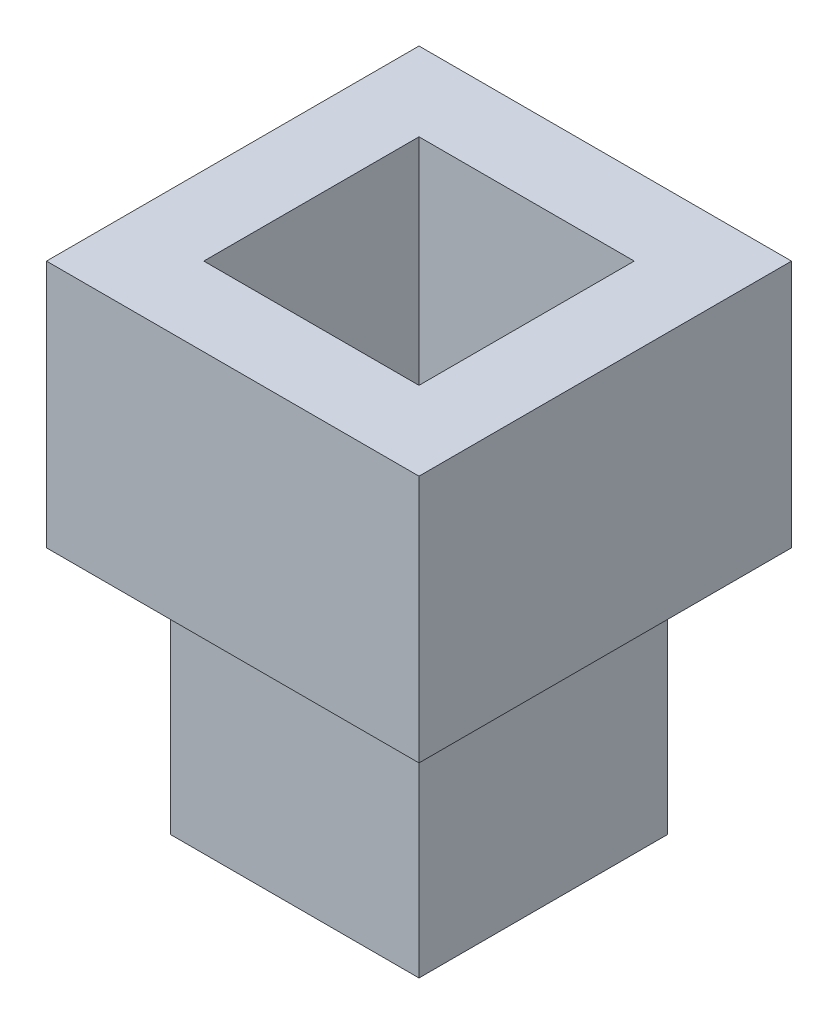
ISO-10303-21;
HEADER;
FILE_DESCRIPTION(('STEP AP214'),'2;1');
FILE_NAME('part.step','',(''),(''),'','','');
FILE_SCHEMA(('AUTOMOTIVE_DESIGN { 1 0 10303 214 1 1 1 1 }'));
ENDSEC;
DATA;
#1=APPLICATION_CONTEXT('core data for automotive mechanical design processes');
#2=APPLICATION_PROTOCOL_DEFINITION('international standard','automotive_design',2000,#1);
#3=PRODUCT_CONTEXT('',#1,'mechanical');
#4=PRODUCT('Part','Part','',(#3));
#5=PRODUCT_RELATED_PRODUCT_CATEGORY('part','',(#4));
#6=PRODUCT_DEFINITION_FORMATION('','',#4);
#7=PRODUCT_DEFINITION_CONTEXT('part definition',#1,'design');
#8=PRODUCT_DEFINITION('design','',#6,#7);
#9=PRODUCT_DEFINITION_SHAPE('','',#8);
#10=(LENGTH_UNIT() NAMED_UNIT(*) SI_UNIT(.MILLI.,.METRE.));
#11=(NAMED_UNIT(*) PLANE_ANGLE_UNIT() SI_UNIT($,.RADIAN.));
#12=(NAMED_UNIT(*) SI_UNIT($,.STERADIAN.) SOLID_ANGLE_UNIT());
#13=UNCERTAINTY_MEASURE_WITH_UNIT(LENGTH_MEASURE(1.E-05),#10,'distance_accuracy_value','');
#14=(GEOMETRIC_REPRESENTATION_CONTEXT(3) GLOBAL_UNCERTAINTY_ASSIGNED_CONTEXT((#13)) GLOBAL_UNIT_ASSIGNED_CONTEXT((#10,
#11,#12)) REPRESENTATION_CONTEXT('',''));
#15=CARTESIAN_POINT('',(0.,0.,0.));
#16=DIRECTION('',(0.,0.,1.));
#17=DIRECTION('',(1.,0.,0.));
#18=AXIS2_PLACEMENT_3D('',#15,#16,#17);
#19=CARTESIAN_POINT('',(0.,30.,0.));
#20=DIRECTION('',(1.,0.,0.));
#21=DIRECTION('',(0.,0.,-1.));
#22=AXIS2_PLACEMENT_3D('',#19,#20,#21);
#23=PLANE('',#22);
#24=DIRECTION('',(0.,0.,1.));
#25=VECTOR('',#24,1.);
#26=CARTESIAN_POINT('',(0.,0.,0.));
#27=LINE('',#26,#25);
#28=CARTESIAN_POINT('',(0.,0.,-30.));
#29=VERTEX_POINT('',#28);
#30=CARTESIAN_POINT('',(0.,0.,0.));
#31=VERTEX_POINT('',#30);
#32=EDGE_CURVE('E243',#29,#31,#27,.T.);
#33=ORIENTED_EDGE('',*,*,#32,.T.);
#34=DIRECTION('',(0.,-1.,0.));
#35=VECTOR('',#34,1.);
#36=CARTESIAN_POINT('',(0.,30.,0.));
#37=LINE('',#36,#35);
#38=CARTESIAN_POINT('',(0.,30.,0.));
#39=VERTEX_POINT('',#38);
#40=EDGE_CURVE('E11',#39,#31,#37,.T.);
#41=ORIENTED_EDGE('',*,*,#40,.F.);
#42=DIRECTION('',(0.,0.,1.));
#43=VECTOR('',#42,1.);
#44=CARTESIAN_POINT('',(0.,30.,0.));
#45=LINE('',#44,#43);
#46=CARTESIAN_POINT('',(0.,30.,-30.));
#47=VERTEX_POINT('',#46);
#48=EDGE_CURVE('E244',#47,#39,#45,.T.);
#49=ORIENTED_EDGE('',*,*,#48,.F.);
#50=DIRECTION('',(0.,-1.,0.));
#51=VECTOR('',#50,1.);
#52=CARTESIAN_POINT('',(0.,30.,-30.));
#53=LINE('',#52,#51);
#54=EDGE_CURVE('E258',#47,#29,#53,.T.);
#55=ORIENTED_EDGE('',*,*,#54,.T.);
#56=EDGE_LOOP('',(#33,#41,#49,#55));
#57=FACE_BOUND('',#56,.T.);
#58=ADVANCED_FACE('F39',(#57),#23,.F.);
#59=CARTESIAN_POINT('',(0.,30.,0.));
#60=DIRECTION('',(0.,0.,-1.));
#61=DIRECTION('',(-1.,0.,0.));
#62=AXIS2_PLACEMENT_3D('',#59,#60,#61);
#63=PLANE('',#62);
#64=DIRECTION('',(1.,0.,0.));
#65=VECTOR('',#64,1.);
#66=CARTESIAN_POINT('',(0.,0.,0.));
#67=LINE('',#66,#65);
#68=CARTESIAN_POINT('',(30.,0.,0.));
#69=VERTEX_POINT('',#68);
#70=EDGE_CURVE('E262',#31,#69,#67,.T.);
#71=ORIENTED_EDGE('',*,*,#70,.T.);
#72=DIRECTION('',(0.,-1.,0.));
#73=VECTOR('',#72,1.);
#74=CARTESIAN_POINT('',(30.,30.,0.));
#75=LINE('',#74,#73);
#76=CARTESIAN_POINT('',(30.,30.,0.));
#77=VERTEX_POINT('',#76);
#78=EDGE_CURVE('E48',#77,#69,#75,.T.);
#79=ORIENTED_EDGE('',*,*,#78,.F.);
#80=DIRECTION('',(1.,0.,0.));
#81=VECTOR('',#80,1.);
#82=CARTESIAN_POINT('',(0.,30.,0.));
#83=LINE('',#82,#81);
#84=EDGE_CURVE('E89',#39,#77,#83,.T.);
#85=ORIENTED_EDGE('',*,*,#84,.F.);
#86=ORIENTED_EDGE('',*,*,#40,.T.);
#87=EDGE_LOOP('',(#71,#79,#85,#86));
#88=FACE_BOUND('',#87,.T.);
#89=ADVANCED_FACE('F302',(#88),#63,.F.);
#90=CARTESIAN_POINT('',(30.,30.,0.));
#91=DIRECTION('',(-1.,0.,0.));
#92=DIRECTION('',(0.,0.,1.));
#93=AXIS2_PLACEMENT_3D('',#90,#91,#92);
#94=PLANE('',#93);
#95=DIRECTION('',(0.,0.,-1.));
#96=VECTOR('',#95,1.);
#97=CARTESIAN_POINT('',(30.,0.,0.));
#98=LINE('',#97,#96);
#99=CARTESIAN_POINT('',(30.,0.,-30.));
#100=VERTEX_POINT('',#99);
#101=EDGE_CURVE('E265',#69,#100,#98,.T.);
#102=ORIENTED_EDGE('',*,*,#101,.T.);
#103=DIRECTION('',(0.,-1.,0.));
#104=VECTOR('',#103,1.);
#105=CARTESIAN_POINT('',(30.,30.,-30.));
#106=LINE('',#105,#104);
#107=CARTESIAN_POINT('',(30.,30.,-30.));
#108=VERTEX_POINT('',#107);
#109=EDGE_CURVE('E64',#108,#100,#106,.T.);
#110=ORIENTED_EDGE('',*,*,#109,.F.);
#111=DIRECTION('',(0.,0.,-1.));
#112=VECTOR('',#111,1.);
#113=CARTESIAN_POINT('',(30.,30.,0.));
#114=LINE('',#113,#112);
#115=EDGE_CURVE('E250',#77,#108,#114,.T.);
#116=ORIENTED_EDGE('',*,*,#115,.F.);
#117=ORIENTED_EDGE('',*,*,#78,.T.);
#118=EDGE_LOOP('',(#102,#110,#116,#117));
#119=FACE_BOUND('',#118,.T.);
#120=ADVANCED_FACE('F277',(#119),#94,.F.);
#121=CARTESIAN_POINT('',(0.,30.,-30.));
#122=DIRECTION('',(0.,0.,1.));
#123=DIRECTION('',(1.,0.,0.));
#124=AXIS2_PLACEMENT_3D('',#121,#122,#123);
#125=PLANE('',#124);
#126=DIRECTION('',(-1.,0.,0.));
#127=VECTOR('',#126,1.);
#128=CARTESIAN_POINT('',(0.,0.,-30.));
#129=LINE('',#128,#127);
#130=EDGE_CURVE('E84',#100,#29,#129,.T.);
#131=ORIENTED_EDGE('',*,*,#130,.T.);
#132=ORIENTED_EDGE('',*,*,#54,.F.);
#133=DIRECTION('',(-1.,0.,0.));
#134=VECTOR('',#133,1.);
#135=CARTESIAN_POINT('',(0.,30.,-30.));
#136=LINE('',#135,#134);
#137=EDGE_CURVE('E254',#108,#47,#136,.T.);
#138=ORIENTED_EDGE('',*,*,#137,.F.);
#139=ORIENTED_EDGE('',*,*,#109,.T.);
#140=EDGE_LOOP('',(#131,#132,#138,#139));
#141=FACE_BOUND('',#140,.T.);
#142=ADVANCED_FACE('F282',(#141),#125,.F.);
#143=CARTESIAN_POINT('',(0.,0.,0.));
#144=DIRECTION('',(0.,-1.,0.));
#145=DIRECTION('',(0.,0.,-1.));
#146=AXIS2_PLACEMENT_3D('',#143,#144,#145);
#147=PLANE('',#146);
#148=CARTESIAN_POINT('',(25.,0.,-5.));
#149=DIRECTION('',(0.,-1.,0.));
#150=DIRECTION('',(0.,0.,-1.));
#151=AXIS2_PLACEMENT_3D('',#148,#149,#150);
#152=CIRCLE('',#151,2.5);
#153=CARTESIAN_POINT('',(25.,0.,-7.5));
#154=VERTEX_POINT('',#153);
#155=EDGE_CURVE('E416',#154,#154,#152,.T.);
#156=ORIENTED_EDGE('',*,*,#155,.F.);
#157=EDGE_LOOP('',(#156));
#158=FACE_BOUND('',#157,.T.);
#159=CARTESIAN_POINT('',(5.,0.,-5.));
#160=DIRECTION('',(0.,-1.,0.));
#161=DIRECTION('',(0.,0.,-1.));
#162=AXIS2_PLACEMENT_3D('',#159,#160,#161);
#163=CIRCLE('',#162,2.5);
#164=CARTESIAN_POINT('',(5.,0.,-7.5));
#165=VERTEX_POINT('',#164);
#166=EDGE_CURVE('E408',#165,#165,#163,.T.);
#167=ORIENTED_EDGE('',*,*,#166,.F.);
#168=EDGE_LOOP('',(#167));
#169=FACE_BOUND('',#168,.T.);
#170=CARTESIAN_POINT('',(5.,0.,-25.));
#171=DIRECTION('',(0.,-1.,0.));
#172=DIRECTION('',(0.,0.,-1.));
#173=AXIS2_PLACEMENT_3D('',#170,#171,#172);
#174=CIRCLE('',#173,2.5);
#175=CARTESIAN_POINT('',(5.,0.,-27.5));
#176=VERTEX_POINT('',#175);
#177=EDGE_CURVE('E396',#176,#176,#174,.T.);
#178=ORIENTED_EDGE('',*,*,#177,.F.);
#179=EDGE_LOOP('',(#178));
#180=FACE_BOUND('',#179,.T.);
#181=CARTESIAN_POINT('',(25.,0.,-25.));
#182=DIRECTION('',(0.,-1.,0.));
#183=DIRECTION('',(0.,0.,-1.));
#184=AXIS2_PLACEMENT_3D('',#181,#182,#183);
#185=CIRCLE('',#184,2.5);
#186=CARTESIAN_POINT('',(25.,0.,-27.5));
#187=VERTEX_POINT('',#186);
#188=EDGE_CURVE('E170',#187,#187,#185,.T.);
#189=ORIENTED_EDGE('',*,*,#188,.F.);
#190=EDGE_LOOP('',(#189));
#191=FACE_BOUND('',#190,.T.);
#192=ORIENTED_EDGE('',*,*,#32,.F.);
#193=ORIENTED_EDGE('',*,*,#130,.F.);
#194=ORIENTED_EDGE('',*,*,#101,.F.);
#195=ORIENTED_EDGE('',*,*,#70,.F.);
#196=EDGE_LOOP('',(#192,#193,#194,#195));
#197=FACE_BOUND('',#196,.T.);
#198=ADVANCED_FACE('F280',(#158,#169,#180,#191,#197),#147,.T.);
#199=CARTESIAN_POINT('',(0.,30.,0.));
#200=DIRECTION('',(0.,1.,0.));
#201=DIRECTION('',(0.,0.,1.));
#202=AXIS2_PLACEMENT_3D('',#199,#200,#201);
#203=PLANE('',#202);
#204=DIRECTION('',(0.,0.,1.));
#205=VECTOR('',#204,1.);
#206=CARTESIAN_POINT('',(-7.50000000000001,30.,-37.5));
#207=LINE('',#206,#205);
#208=CARTESIAN_POINT('',(-7.50000000000001,30.,-37.5));
#209=VERTEX_POINT('',#208);
#210=CARTESIAN_POINT('',(-7.5,30.,7.5));
#211=VERTEX_POINT('',#210);
#212=EDGE_CURVE('E214',#209,#211,#207,.T.);
#213=ORIENTED_EDGE('',*,*,#212,.F.);
#214=DIRECTION('',(-1.,0.,0.));
#215=VECTOR('',#214,1.);
#216=CARTESIAN_POINT('',(-7.50000000000001,30.,-37.5));
#217=LINE('',#216,#215);
#218=CARTESIAN_POINT('',(37.5,30.,-37.5));
#219=VERTEX_POINT('',#218);
#220=EDGE_CURVE('E224',#219,#209,#217,.T.);
#221=ORIENTED_EDGE('',*,*,#220,.F.);
#222=DIRECTION('',(0.,0.,-1.));
#223=VECTOR('',#222,1.);
#224=CARTESIAN_POINT('',(37.5,30.,-37.5));
#225=LINE('',#224,#223);
#226=CARTESIAN_POINT('',(37.5,30.,7.5));
#227=VERTEX_POINT('',#226);
#228=EDGE_CURVE('E221',#227,#219,#225,.T.);
#229=ORIENTED_EDGE('',*,*,#228,.F.);
#230=DIRECTION('',(1.,0.,0.));
#231=VECTOR('',#230,1.);
#232=CARTESIAN_POINT('',(-7.5,30.,7.5));
#233=LINE('',#232,#231);
#234=EDGE_CURVE('E218',#211,#227,#233,.T.);
#235=ORIENTED_EDGE('',*,*,#234,.F.);
#236=EDGE_LOOP('',(#213,#221,#229,#235));
#237=FACE_BOUND('',#236,.T.);
#238=ORIENTED_EDGE('',*,*,#137,.T.);
#239=ORIENTED_EDGE('',*,*,#48,.T.);
#240=ORIENTED_EDGE('',*,*,#84,.T.);
#241=ORIENTED_EDGE('',*,*,#115,.T.);
#242=EDGE_LOOP('',(#238,#239,#240,#241));
#243=FACE_BOUND('',#242,.T.);
#244=ADVANCED_FACE('F284',(#237,#243),#203,.F.);
#245=CARTESIAN_POINT('',(-7.50000000000001,40.,-37.5));
#246=DIRECTION('',(1.,0.,0.));
#247=DIRECTION('',(0.,0.,-1.));
#248=AXIS2_PLACEMENT_3D('',#245,#246,#247);
#249=PLANE('',#248);
#250=ORIENTED_EDGE('',*,*,#212,.T.);
#251=DIRECTION('',(0.,-1.,0.));
#252=VECTOR('',#251,1.);
#253=CARTESIAN_POINT('',(-7.5,40.,7.5));
#254=LINE('',#253,#252);
#255=CARTESIAN_POINT('',(-7.50000000000001,60.,7.5));
#256=VERTEX_POINT('',#255);
#257=EDGE_CURVE('E239',#256,#211,#254,.T.);
#258=ORIENTED_EDGE('',*,*,#257,.F.);
#259=DIRECTION('',(0.,0.,1.));
#260=VECTOR('',#259,1.);
#261=CARTESIAN_POINT('',(-7.50000000000001,60.,-37.5));
#262=LINE('',#261,#260);
#263=CARTESIAN_POINT('',(-7.50000000000001,60.,-37.5));
#264=VERTEX_POINT('',#263);
#265=EDGE_CURVE('E198',#264,#256,#262,.T.);
#266=ORIENTED_EDGE('',*,*,#265,.F.);
#267=DIRECTION('',(0.,-1.,0.));
#268=VECTOR('',#267,1.);
#269=CARTESIAN_POINT('',(-7.50000000000001,40.,-37.5));
#270=LINE('',#269,#268);
#271=EDGE_CURVE('E227',#264,#209,#270,.T.);
#272=ORIENTED_EDGE('',*,*,#271,.T.);
#273=EDGE_LOOP('',(#250,#258,#266,#272));
#274=FACE_BOUND('',#273,.T.);
#275=ADVANCED_FACE('F286',(#274),#249,.F.);
#276=CARTESIAN_POINT('',(-7.5,40.,7.5));
#277=DIRECTION('',(0.,0.,-1.));
#278=DIRECTION('',(-1.,0.,0.));
#279=AXIS2_PLACEMENT_3D('',#276,#277,#278);
#280=PLANE('',#279);
#281=ORIENTED_EDGE('',*,*,#234,.T.);
#282=DIRECTION('',(0.,-1.,0.));
#283=VECTOR('',#282,1.);
#284=CARTESIAN_POINT('',(37.5,40.,7.5));
#285=LINE('',#284,#283);
#286=CARTESIAN_POINT('',(37.5,60.,7.5));
#287=VERTEX_POINT('',#286);
#288=EDGE_CURVE('E235',#287,#227,#285,.T.);
#289=ORIENTED_EDGE('',*,*,#288,.F.);
#290=DIRECTION('',(1.,0.,0.));
#291=VECTOR('',#290,1.);
#292=CARTESIAN_POINT('',(-7.50000000000001,60.,7.5));
#293=LINE('',#292,#291);
#294=EDGE_CURVE('E202',#256,#287,#293,.T.);
#295=ORIENTED_EDGE('',*,*,#294,.F.);
#296=ORIENTED_EDGE('',*,*,#257,.T.);
#297=EDGE_LOOP('',(#281,#289,#295,#296));
#298=FACE_BOUND('',#297,.T.);
#299=ADVANCED_FACE('F293',(#298),#280,.F.);
#300=CARTESIAN_POINT('',(37.5,40.,-37.5));
#301=DIRECTION('',(-1.,0.,0.));
#302=DIRECTION('',(0.,0.,1.));
#303=AXIS2_PLACEMENT_3D('',#300,#301,#302);
#304=PLANE('',#303);
#305=ORIENTED_EDGE('',*,*,#228,.T.);
#306=DIRECTION('',(0.,-1.,0.));
#307=VECTOR('',#306,1.);
#308=CARTESIAN_POINT('',(37.5,40.,-37.5));
#309=LINE('',#308,#307);
#310=CARTESIAN_POINT('',(37.5,60.,-37.5));
#311=VERTEX_POINT('',#310);
#312=EDGE_CURVE('E231',#311,#219,#309,.T.);
#313=ORIENTED_EDGE('',*,*,#312,.F.);
#314=DIRECTION('',(0.,0.,-1.));
#315=VECTOR('',#314,1.);
#316=CARTESIAN_POINT('',(37.5,60.,-37.5));
#317=LINE('',#316,#315);
#318=EDGE_CURVE('E206',#287,#311,#317,.T.);
#319=ORIENTED_EDGE('',*,*,#318,.F.);
#320=ORIENTED_EDGE('',*,*,#288,.T.);
#321=EDGE_LOOP('',(#305,#313,#319,#320));
#322=FACE_BOUND('',#321,.T.);
#323=ADVANCED_FACE('F315',(#322),#304,.F.);
#324=CARTESIAN_POINT('',(-7.50000000000001,40.,-37.5));
#325=DIRECTION('',(0.,0.,1.));
#326=DIRECTION('',(1.,0.,0.));
#327=AXIS2_PLACEMENT_3D('',#324,#325,#326);
#328=PLANE('',#327);
#329=ORIENTED_EDGE('',*,*,#220,.T.);
#330=ORIENTED_EDGE('',*,*,#271,.F.);
#331=DIRECTION('',(-1.,0.,0.));
#332=VECTOR('',#331,1.);
#333=CARTESIAN_POINT('',(-7.50000000000001,60.,-37.5));
#334=LINE('',#333,#332);
#335=EDGE_CURVE('E210',#311,#264,#334,.T.);
#336=ORIENTED_EDGE('',*,*,#335,.F.);
#337=ORIENTED_EDGE('',*,*,#312,.T.);
#338=EDGE_LOOP('',(#329,#330,#336,#337));
#339=FACE_BOUND('',#338,.T.);
#340=ADVANCED_FACE('F318',(#339),#328,.F.);
#341=CARTESIAN_POINT('',(0.,60.,0.));
#342=DIRECTION('',(0.,1.,0.));
#343=DIRECTION('',(0.,0.,1.));
#344=AXIS2_PLACEMENT_3D('',#341,#342,#343);
#345=PLANE('',#344);
#346=DIRECTION('',(0.,0.,1.));
#347=VECTOR('',#346,1.);
#348=CARTESIAN_POINT('',(1.99999999999999,60.,-2.));
#349=LINE('',#348,#347);
#350=CARTESIAN_POINT('',(1.99999999999999,60.,-28.));
#351=VERTEX_POINT('',#350);
#352=CARTESIAN_POINT('',(1.99999999999999,60.,-2.));
#353=VERTEX_POINT('',#352);
#354=EDGE_CURVE('E55',#351,#353,#349,.T.);
#355=ORIENTED_EDGE('',*,*,#354,.F.);
#356=DIRECTION('',(-1.,0.,0.));
#357=VECTOR('',#356,1.);
#358=CARTESIAN_POINT('',(1.99999999999999,60.,-28.));
#359=LINE('',#358,#357);
#360=CARTESIAN_POINT('',(28.,60.,-28.));
#361=VERTEX_POINT('',#360);
#362=EDGE_CURVE('E163',#361,#351,#359,.T.);
#363=ORIENTED_EDGE('',*,*,#362,.F.);
#364=DIRECTION('',(0.,0.,-1.));
#365=VECTOR('',#364,1.);
#366=CARTESIAN_POINT('',(28.,60.,-2.));
#367=LINE('',#366,#365);
#368=CARTESIAN_POINT('',(28.,60.,-2.));
#369=VERTEX_POINT('',#368);
#370=EDGE_CURVE('E167',#369,#361,#367,.T.);
#371=ORIENTED_EDGE('',*,*,#370,.F.);
#372=DIRECTION('',(1.,0.,0.));
#373=VECTOR('',#372,1.);
#374=CARTESIAN_POINT('',(1.99999999999999,60.,-2.));
#375=LINE('',#374,#373);
#376=EDGE_CURVE('E179',#353,#369,#375,.T.);
#377=ORIENTED_EDGE('',*,*,#376,.F.);
#378=EDGE_LOOP('',(#355,#363,#371,#377));
#379=FACE_BOUND('',#378,.T.);
#380=ORIENTED_EDGE('',*,*,#265,.T.);
#381=ORIENTED_EDGE('',*,*,#294,.T.);
#382=ORIENTED_EDGE('',*,*,#318,.T.);
#383=ORIENTED_EDGE('',*,*,#335,.T.);
#384=EDGE_LOOP('',(#380,#381,#382,#383));
#385=FACE_BOUND('',#384,.T.);
#386=ADVANCED_FACE('F321',(#379,#385),#345,.T.);
#387=CARTESIAN_POINT('',(0.,30.,0.));
#388=DIRECTION('',(0.,-1.,0.));
#389=DIRECTION('',(0.,0.,-1.));
#390=AXIS2_PLACEMENT_3D('',#387,#388,#389);
#391=PLANE('',#390);
#392=DIRECTION('',(0.,0.,1.));
#393=VECTOR('',#392,1.);
#394=CARTESIAN_POINT('',(1.99999999999999,30.,-2.));
#395=LINE('',#394,#393);
#396=CARTESIAN_POINT('',(1.99999999999999,30.,-28.));
#397=VERTEX_POINT('',#396);
#398=CARTESIAN_POINT('',(1.99999999999999,30.,-2.));
#399=VERTEX_POINT('',#398);
#400=EDGE_CURVE('E141',#397,#399,#395,.T.);
#401=ORIENTED_EDGE('',*,*,#400,.T.);
#402=DIRECTION('',(1.,0.,0.));
#403=VECTOR('',#402,1.);
#404=CARTESIAN_POINT('',(1.99999999999999,30.,-2.));
#405=LINE('',#404,#403);
#406=CARTESIAN_POINT('',(28.,30.,-2.));
#407=VERTEX_POINT('',#406);
#408=EDGE_CURVE('E151',#399,#407,#405,.T.);
#409=ORIENTED_EDGE('',*,*,#408,.T.);
#410=DIRECTION('',(0.,0.,-1.));
#411=VECTOR('',#410,1.);
#412=CARTESIAN_POINT('',(28.,30.,-2.));
#413=LINE('',#412,#411);
#414=CARTESIAN_POINT('',(28.,30.,-28.));
#415=VERTEX_POINT('',#414);
#416=EDGE_CURVE('E157',#407,#415,#413,.T.);
#417=ORIENTED_EDGE('',*,*,#416,.T.);
#418=DIRECTION('',(-1.,0.,0.));
#419=VECTOR('',#418,1.);
#420=CARTESIAN_POINT('',(1.99999999999999,30.,-28.));
#421=LINE('',#420,#419);
#422=EDGE_CURVE('E148',#415,#397,#421,.T.);
#423=ORIENTED_EDGE('',*,*,#422,.T.);
#424=EDGE_LOOP('',(#401,#409,#417,#423));
#425=FACE_BOUND('',#424,.T.);
#426=CARTESIAN_POINT('',(15.,30.,-15.));
#427=DIRECTION('',(0.,-1.,0.));
#428=DIRECTION('',(0.,0.,-1.));
#429=AXIS2_PLACEMENT_3D('',#426,#427,#428);
#430=CIRCLE('',#429,9.5);
#431=CARTESIAN_POINT('',(15.,30.,-24.5));
#432=VERTEX_POINT('',#431);
#433=EDGE_CURVE('E42',#432,#432,#430,.F.);
#434=ORIENTED_EDGE('',*,*,#433,.F.);
#435=EDGE_LOOP('',(#434));
#436=FACE_BOUND('',#435,.T.);
#437=ADVANCED_FACE('F159',(#425,#436),#391,.F.);
#438=CARTESIAN_POINT('',(1.99999999999999,30.,-2.));
#439=DIRECTION('',(-1.,0.,0.));
#440=DIRECTION('',(0.,0.,1.));
#441=AXIS2_PLACEMENT_3D('',#438,#439,#440);
#442=PLANE('',#441);
#443=ORIENTED_EDGE('',*,*,#354,.T.);
#444=DIRECTION('',(0.,1.,0.));
#445=VECTOR('',#444,1.);
#446=CARTESIAN_POINT('',(1.99999999999999,30.,-2.));
#447=LINE('',#446,#445);
#448=EDGE_CURVE('E137',#399,#353,#447,.T.);
#449=ORIENTED_EDGE('',*,*,#448,.F.);
#450=ORIENTED_EDGE('',*,*,#400,.F.);
#451=DIRECTION('',(0.,1.,0.));
#452=VECTOR('',#451,1.);
#453=CARTESIAN_POINT('',(1.99999999999999,30.,-28.));
#454=LINE('',#453,#452);
#455=EDGE_CURVE('E186',#397,#351,#454,.T.);
#456=ORIENTED_EDGE('',*,*,#455,.T.);
#457=EDGE_LOOP('',(#443,#449,#450,#456));
#458=FACE_BOUND('',#457,.T.);
#459=ADVANCED_FACE('F139',(#458),#442,.F.);
#460=CARTESIAN_POINT('',(1.99999999999999,30.,-28.));
#461=DIRECTION('',(0.,0.,-1.));
#462=DIRECTION('',(-1.,0.,0.));
#463=AXIS2_PLACEMENT_3D('',#460,#461,#462);
#464=PLANE('',#463);
#465=ORIENTED_EDGE('',*,*,#362,.T.);
#466=ORIENTED_EDGE('',*,*,#455,.F.);
#467=ORIENTED_EDGE('',*,*,#422,.F.);
#468=DIRECTION('',(0.,1.,0.));
#469=VECTOR('',#468,1.);
#470=CARTESIAN_POINT('',(28.,30.,-28.));
#471=LINE('',#470,#469);
#472=EDGE_CURVE('E189',#415,#361,#471,.T.);
#473=ORIENTED_EDGE('',*,*,#472,.T.);
#474=EDGE_LOOP('',(#465,#466,#467,#473));
#475=FACE_BOUND('',#474,.T.);
#476=ADVANCED_FACE('F350',(#475),#464,.F.);
#477=CARTESIAN_POINT('',(28.,30.,-2.));
#478=DIRECTION('',(1.,0.,0.));
#479=DIRECTION('',(0.,0.,-1.));
#480=AXIS2_PLACEMENT_3D('',#477,#478,#479);
#481=PLANE('',#480);
#482=ORIENTED_EDGE('',*,*,#370,.T.);
#483=ORIENTED_EDGE('',*,*,#472,.F.);
#484=ORIENTED_EDGE('',*,*,#416,.F.);
#485=DIRECTION('',(0.,1.,0.));
#486=VECTOR('',#485,1.);
#487=CARTESIAN_POINT('',(28.,30.,-2.));
#488=LINE('',#487,#486);
#489=EDGE_CURVE('E147',#407,#369,#488,.T.);
#490=ORIENTED_EDGE('',*,*,#489,.T.);
#491=EDGE_LOOP('',(#482,#483,#484,#490));
#492=FACE_BOUND('',#491,.T.);
#493=ADVANCED_FACE('F353',(#492),#481,.F.);
#494=CARTESIAN_POINT('',(1.99999999999999,30.,-2.));
#495=DIRECTION('',(0.,0.,1.));
#496=DIRECTION('',(1.,0.,0.));
#497=AXIS2_PLACEMENT_3D('',#494,#495,#496);
#498=PLANE('',#497);
#499=ORIENTED_EDGE('',*,*,#376,.T.);
#500=ORIENTED_EDGE('',*,*,#489,.F.);
#501=ORIENTED_EDGE('',*,*,#408,.F.);
#502=ORIENTED_EDGE('',*,*,#448,.T.);
#503=EDGE_LOOP('',(#499,#500,#501,#502));
#504=FACE_BOUND('',#503,.T.);
#505=ADVANCED_FACE('F152',(#504),#498,.F.);
#506=CARTESIAN_POINT('',(15.,20.,-15.));
#507=DIRECTION('',(0.,1.,0.));
#508=DIRECTION('',(0.,0.,1.));
#509=AXIS2_PLACEMENT_3D('',#506,#507,#508);
#510=PLANE('',#509);
#511=CARTESIAN_POINT('',(15.,20.,-15.));
#512=DIRECTION('',(0.,1.,0.));
#513=DIRECTION('',(0.,0.,1.));
#514=AXIS2_PLACEMENT_3D('',#511,#512,#513);
#515=CIRCLE('',#514,9.5);
#516=CARTESIAN_POINT('',(15.,20.,-5.50000000000001));
#517=VERTEX_POINT('',#516);
#518=EDGE_CURVE('E194',#517,#517,#515,.T.);
#519=ORIENTED_EDGE('',*,*,#518,.T.);
#520=EDGE_LOOP('',(#519));
#521=FACE_BOUND('',#520,.T.);
#522=ADVANCED_FACE('F343',(#521),#510,.T.);
#523=CARTESIAN_POINT('',(15.,20.,-15.));
#524=DIRECTION('',(0.,1.,0.));
#525=DIRECTION('',(0.,0.,1.));
#526=AXIS2_PLACEMENT_3D('',#523,#524,#525);
#527=CYLINDRICAL_SURFACE('',#526,9.5);
#528=ORIENTED_EDGE('',*,*,#433,.T.);
#529=EDGE_LOOP('',(#528));
#530=FACE_BOUND('',#529,.T.);
#531=ORIENTED_EDGE('',*,*,#518,.F.);
#532=EDGE_LOOP('',(#531));
#533=FACE_BOUND('',#532,.T.);
#534=ADVANCED_FACE('F339',(#530,#533),#527,.F.);
#535=CARTESIAN_POINT('',(25.,20.,-25.));
#536=DIRECTION('',(0.,-1.,0.));
#537=DIRECTION('',(0.,0.,-1.));
#538=AXIS2_PLACEMENT_3D('',#535,#536,#537);
#539=CYLINDRICAL_SURFACE('',#538,2.5);
#540=CARTESIAN_POINT('',(25.,20.,-25.));
#541=DIRECTION('',(0.,-1.,0.));
#542=DIRECTION('',(0.,0.,-1.));
#543=AXIS2_PLACEMENT_3D('',#540,#541,#542);
#544=CIRCLE('',#543,2.5);
#545=CARTESIAN_POINT('',(25.,20.,-27.5));
#546=VERTEX_POINT('',#545);
#547=EDGE_CURVE('E180',#546,#546,#544,.T.);
#548=ORIENTED_EDGE('',*,*,#547,.F.);
#549=EDGE_LOOP('',(#548));
#550=FACE_BOUND('',#549,.T.);
#551=ORIENTED_EDGE('',*,*,#188,.T.);
#552=EDGE_LOOP('',(#551));
#553=FACE_BOUND('',#552,.T.);
#554=ADVANCED_FACE('F342',(#550,#553),#539,.F.);
#555=CARTESIAN_POINT('',(25.,20.,-25.));
#556=DIRECTION('',(0.,-1.,0.));
#557=DIRECTION('',(0.,0.,-1.));
#558=AXIS2_PLACEMENT_3D('',#555,#556,#557);
#559=PLANE('',#558);
#560=ORIENTED_EDGE('',*,*,#547,.T.);
#561=EDGE_LOOP('',(#560));
#562=FACE_BOUND('',#561,.T.);
#563=ADVANCED_FACE('F362',(#562),#559,.T.);
#564=CARTESIAN_POINT('',(5.,20.,-25.));
#565=DIRECTION('',(0.,-1.,0.));
#566=DIRECTION('',(0.,0.,-1.));
#567=AXIS2_PLACEMENT_3D('',#564,#565,#566);
#568=CYLINDRICAL_SURFACE('',#567,2.5);
#569=CARTESIAN_POINT('',(5.,20.,-25.));
#570=DIRECTION('',(0.,-1.,0.));
#571=DIRECTION('',(0.,0.,-1.));
#572=AXIS2_PLACEMENT_3D('',#569,#570,#571);
#573=CIRCLE('',#572,2.5);
#574=CARTESIAN_POINT('',(5.,20.,-27.5));
#575=VERTEX_POINT('',#574);
#576=EDGE_CURVE('E394',#575,#575,#573,.T.);
#577=ORIENTED_EDGE('',*,*,#576,.F.);
#578=EDGE_LOOP('',(#577));
#579=FACE_BOUND('',#578,.T.);
#580=ORIENTED_EDGE('',*,*,#177,.T.);
#581=EDGE_LOOP('',(#580));
#582=FACE_BOUND('',#581,.T.);
#583=ADVANCED_FACE('F366',(#579,#582),#568,.F.);
#584=CARTESIAN_POINT('',(5.,20.,-25.));
#585=DIRECTION('',(0.,-1.,0.));
#586=DIRECTION('',(0.,0.,-1.));
#587=AXIS2_PLACEMENT_3D('',#584,#585,#586);
#588=PLANE('',#587);
#589=ORIENTED_EDGE('',*,*,#576,.T.);
#590=EDGE_LOOP('',(#589));
#591=FACE_BOUND('',#590,.T.);
#592=ADVANCED_FACE('F380',(#591),#588,.T.);
#593=CARTESIAN_POINT('',(5.,20.,-5.));
#594=DIRECTION('',(0.,-1.,0.));
#595=DIRECTION('',(0.,0.,-1.));
#596=AXIS2_PLACEMENT_3D('',#593,#594,#595);
#597=CYLINDRICAL_SURFACE('',#596,2.5);
#598=CARTESIAN_POINT('',(5.,20.,-5.));
#599=DIRECTION('',(0.,-1.,0.));
#600=DIRECTION('',(0.,0.,-1.));
#601=AXIS2_PLACEMENT_3D('',#598,#599,#600);
#602=CIRCLE('',#601,2.5);
#603=CARTESIAN_POINT('',(5.,20.,-7.5));
#604=VERTEX_POINT('',#603);
#605=EDGE_CURVE('E402',#604,#604,#602,.T.);
#606=ORIENTED_EDGE('',*,*,#605,.F.);
#607=EDGE_LOOP('',(#606));
#608=FACE_BOUND('',#607,.T.);
#609=ORIENTED_EDGE('',*,*,#166,.T.);
#610=EDGE_LOOP('',(#609));
#611=FACE_BOUND('',#610,.T.);
#612=ADVANCED_FACE('F377',(#608,#611),#597,.F.);
#613=CARTESIAN_POINT('',(5.,20.,-5.));
#614=DIRECTION('',(0.,-1.,0.));
#615=DIRECTION('',(0.,0.,-1.));
#616=AXIS2_PLACEMENT_3D('',#613,#614,#615);
#617=PLANE('',#616);
#618=ORIENTED_EDGE('',*,*,#605,.T.);
#619=EDGE_LOOP('',(#618));
#620=FACE_BOUND('',#619,.T.);
#621=ADVANCED_FACE('F372',(#620),#617,.T.);
#622=CARTESIAN_POINT('',(25.,20.,-5.));
#623=DIRECTION('',(0.,-1.,0.));
#624=DIRECTION('',(0.,0.,-1.));
#625=AXIS2_PLACEMENT_3D('',#622,#623,#624);
#626=CYLINDRICAL_SURFACE('',#625,2.5);
#627=CARTESIAN_POINT('',(25.,20.,-5.));
#628=DIRECTION('',(0.,-1.,0.));
#629=DIRECTION('',(0.,0.,-1.));
#630=AXIS2_PLACEMENT_3D('',#627,#628,#629);
#631=CIRCLE('',#630,2.5);
#632=CARTESIAN_POINT('',(25.,20.,-7.5));
#633=VERTEX_POINT('',#632);
#634=EDGE_CURVE('E412',#633,#633,#631,.T.);
#635=ORIENTED_EDGE('',*,*,#634,.F.);
#636=EDGE_LOOP('',(#635));
#637=FACE_BOUND('',#636,.T.);
#638=ORIENTED_EDGE('',*,*,#155,.T.);
#639=EDGE_LOOP('',(#638));
#640=FACE_BOUND('',#639,.T.);
#641=ADVANCED_FACE('F368',(#637,#640),#626,.F.);
#642=CARTESIAN_POINT('',(25.,20.,-5.));
#643=DIRECTION('',(0.,-1.,0.));
#644=DIRECTION('',(0.,0.,-1.));
#645=AXIS2_PLACEMENT_3D('',#642,#643,#644);
#646=PLANE('',#645);
#647=ORIENTED_EDGE('',*,*,#634,.T.);
#648=EDGE_LOOP('',(#647));
#649=FACE_BOUND('',#648,.T.);
#650=ADVANCED_FACE('F371',(#649),#646,.T.);
#651=CLOSED_SHELL('',(#58,#89,#120,#142,#198,#244,#275,#299,#323,#340,#386,#437,#459,#476,#493,
#505,#522,#534,#554,#563,#583,#592,#612,#621,#641,#650));
#652=MANIFOLD_SOLID_BREP('B2',#651);
#653=ADVANCED_BREP_SHAPE_REPRESENTATION('',(#18,#652),#14);
#654=SHAPE_DEFINITION_REPRESENTATION(#9,#653);
ENDSEC;
END-ISO-10303-21;
